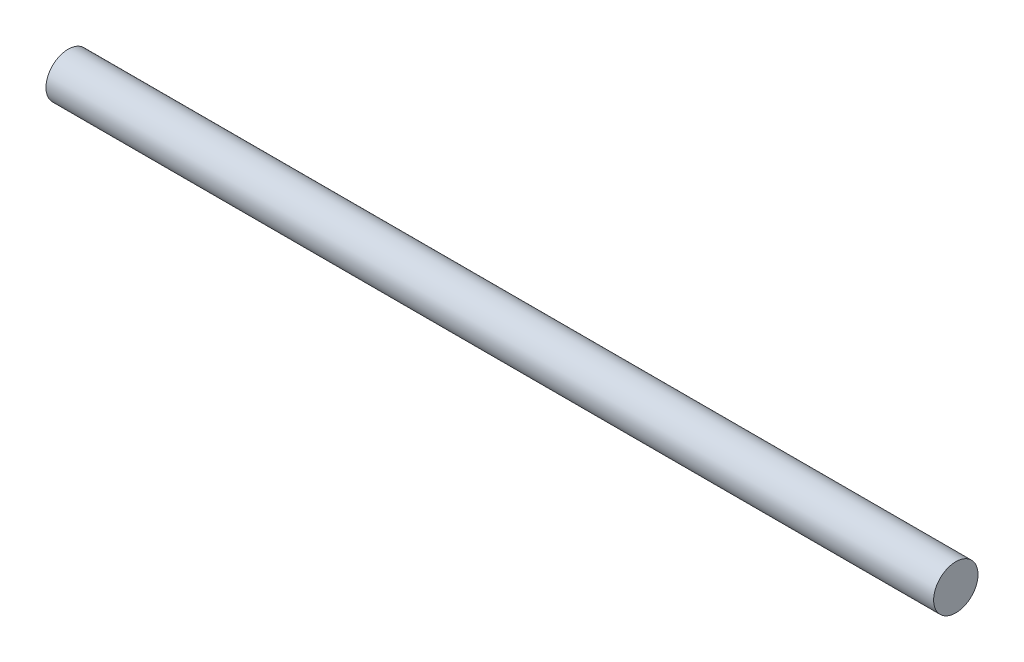
ISO-10303-21;
HEADER;
FILE_DESCRIPTION(('STEP AP214'),'2;1');
FILE_NAME('part.step','',(''),(''),'','','');
FILE_SCHEMA(('AUTOMOTIVE_DESIGN { 1 0 10303 214 1 1 1 1 }'));
ENDSEC;
DATA;
#1=APPLICATION_CONTEXT('core data for automotive mechanical design processes');
#2=APPLICATION_PROTOCOL_DEFINITION('international standard','automotive_design',2000,#1);
#3=PRODUCT_CONTEXT('',#1,'mechanical');
#4=PRODUCT('Part','Part','',(#3));
#5=PRODUCT_RELATED_PRODUCT_CATEGORY('part','',(#4));
#6=PRODUCT_DEFINITION_FORMATION('','',#4);
#7=PRODUCT_DEFINITION_CONTEXT('part definition',#1,'design');
#8=PRODUCT_DEFINITION('design','',#6,#7);
#9=PRODUCT_DEFINITION_SHAPE('','',#8);
#10=(LENGTH_UNIT() NAMED_UNIT(*) SI_UNIT(.MILLI.,.METRE.));
#11=(NAMED_UNIT(*) PLANE_ANGLE_UNIT() SI_UNIT($,.RADIAN.));
#12=(NAMED_UNIT(*) SI_UNIT($,.STERADIAN.) SOLID_ANGLE_UNIT());
#13=UNCERTAINTY_MEASURE_WITH_UNIT(LENGTH_MEASURE(1.E-05),#10,'distance_accuracy_value','');
#14=(GEOMETRIC_REPRESENTATION_CONTEXT(3) GLOBAL_UNCERTAINTY_ASSIGNED_CONTEXT((#13)) GLOBAL_UNIT_ASSIGNED_CONTEXT((#10,
#11,#12)) REPRESENTATION_CONTEXT('',''));
#15=CARTESIAN_POINT('',(0.,0.,0.));
#16=DIRECTION('',(0.,0.,1.));
#17=DIRECTION('',(1.,0.,0.));
#18=AXIS2_PLACEMENT_3D('',#15,#16,#17);
#19=CARTESIAN_POINT('',(40.,0.,0.));
#20=DIRECTION('',(-1.,0.,0.));
#21=DIRECTION('',(0.,0.,1.));
#22=AXIS2_PLACEMENT_3D('',#19,#20,#21);
#23=CYLINDRICAL_SURFACE('',#22,1.);
#24=CARTESIAN_POINT('',(40.,0.,0.));
#25=DIRECTION('',(1.,0.,0.));
#26=DIRECTION('',(0.,0.,-1.));
#27=AXIS2_PLACEMENT_3D('',#24,#25,#26);
#28=CIRCLE('',#27,1.);
#29=CARTESIAN_POINT('',(40.,0.,-1.));
#30=VERTEX_POINT('',#29);
#31=EDGE_CURVE('E10',#30,#30,#28,.T.);
#32=ORIENTED_EDGE('',*,*,#31,.F.);
#33=EDGE_LOOP('',(#32));
#34=FACE_BOUND('',#33,.T.);
#35=CARTESIAN_POINT('',(0.,0.,0.));
#36=DIRECTION('',(1.,0.,0.));
#37=DIRECTION('',(0.,0.,-1.));
#38=AXIS2_PLACEMENT_3D('',#35,#36,#37);
#39=CIRCLE('',#38,1.);
#40=CARTESIAN_POINT('',(0.,0.,-1.));
#41=VERTEX_POINT('',#40);
#42=EDGE_CURVE('E34',#41,#41,#39,.T.);
#43=ORIENTED_EDGE('',*,*,#42,.T.);
#44=EDGE_LOOP('',(#43));
#45=FACE_BOUND('',#44,.T.);
#46=ADVANCED_FACE('F31',(#34,#45),#23,.T.);
#47=CARTESIAN_POINT('',(40.,0.,0.));
#48=DIRECTION('',(1.,0.,0.));
#49=DIRECTION('',(0.,0.,-1.));
#50=AXIS2_PLACEMENT_3D('',#47,#48,#49);
#51=PLANE('',#50);
#52=ORIENTED_EDGE('',*,*,#31,.T.);
#53=EDGE_LOOP('',(#52));
#54=FACE_BOUND('',#53,.T.);
#55=ADVANCED_FACE('F46',(#54),#51,.T.);
#56=CARTESIAN_POINT('',(0.,0.,0.));
#57=DIRECTION('',(1.,0.,0.));
#58=DIRECTION('',(0.,0.,-1.));
#59=AXIS2_PLACEMENT_3D('',#56,#57,#58);
#60=PLANE('',#59);
#61=ORIENTED_EDGE('',*,*,#42,.F.);
#62=EDGE_LOOP('',(#61));
#63=FACE_BOUND('',#62,.T.);
#64=ADVANCED_FACE('F44',(#63),#60,.F.);
#65=CLOSED_SHELL('',(#46,#55,#64));
#66=MANIFOLD_SOLID_BREP('B2',#65);
#67=ADVANCED_BREP_SHAPE_REPRESENTATION('',(#18,#66),#14);
#68=SHAPE_DEFINITION_REPRESENTATION(#9,#67);
ENDSEC;
END-ISO-10303-21;
